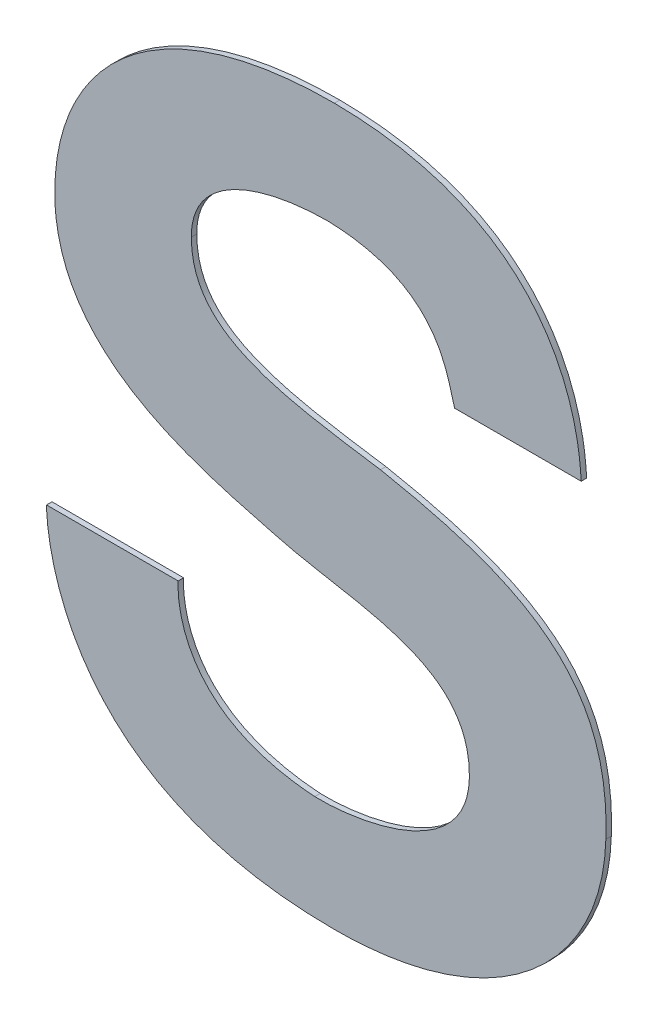
ISO-10303-21;
HEADER;
FILE_DESCRIPTION(('STEP AP214'),'2;1');
FILE_NAME('part.step','',(''),(''),'','','');
FILE_SCHEMA(('AUTOMOTIVE_DESIGN { 1 0 10303 214 1 1 1 1 }'));
ENDSEC;
DATA;
#1=APPLICATION_CONTEXT('core data for automotive mechanical design processes');
#2=APPLICATION_PROTOCOL_DEFINITION('international standard','automotive_design',2000,#1);
#3=PRODUCT_CONTEXT('',#1,'mechanical');
#4=PRODUCT('Part','Part','',(#3));
#5=PRODUCT_RELATED_PRODUCT_CATEGORY('part','',(#4));
#6=PRODUCT_DEFINITION_FORMATION('','',#4);
#7=PRODUCT_DEFINITION_CONTEXT('part definition',#1,'design');
#8=PRODUCT_DEFINITION('design','',#6,#7);
#9=PRODUCT_DEFINITION_SHAPE('','',#8);
#10=(LENGTH_UNIT() NAMED_UNIT(*) SI_UNIT(.MILLI.,.METRE.));
#11=(NAMED_UNIT(*) PLANE_ANGLE_UNIT() SI_UNIT($,.RADIAN.));
#12=(NAMED_UNIT(*) SI_UNIT($,.STERADIAN.) SOLID_ANGLE_UNIT());
#13=UNCERTAINTY_MEASURE_WITH_UNIT(LENGTH_MEASURE(1.E-05),#10,'distance_accuracy_value','');
#14=(GEOMETRIC_REPRESENTATION_CONTEXT(3) GLOBAL_UNCERTAINTY_ASSIGNED_CONTEXT((#13)) GLOBAL_UNIT_ASSIGNED_CONTEXT((#10,
#11,#12)) REPRESENTATION_CONTEXT('',''));
#15=CARTESIAN_POINT('',(0.,0.,0.));
#16=DIRECTION('',(0.,0.,1.));
#17=DIRECTION('',(1.,0.,0.));
#18=AXIS2_PLACEMENT_3D('',#15,#16,#17);
#19=CARTESIAN_POINT('',(-0.0821500048121,-0.1584020248666,0.00086146168299));
#20=CARTESIAN_POINT('',(-0.0821500048121,-0.1584020248666,-0.00033853831701));
#21=CARTESIAN_POINT('',(-0.1462058680997,-0.1584020248666,0.00086146168299));
#22=CARTESIAN_POINT('',(-0.1462058680997,-0.1584020248666,-0.00033853831701));
#23=CARTESIAN_POINT('',(-0.1454833792289,-0.1091766906306,0.00086146168299));
#24=CARTESIAN_POINT('',(-0.1454833792289,-0.1091766906306,-0.00033853831701));
#25=CARTESIAN_POINT('',(-0.1454833792289,-0.1091766906306,0.00086146168299));
#26=CARTESIAN_POINT('',(-0.1454833792289,-0.1091766906306,-0.00033853831701));
#27=B_SPLINE_SURFACE_WITH_KNOTS('',3,1,((#19,#20),(#21,#22),(#23,#24),(#25,#26)),.UNSPECIFIED.,
.F.,.F.,.F.,(4,4),(2,2),(0.,1.),(-0.003,0.),.UNSPECIFIED.);
#28=DIRECTION('',(0.,0.,1.));
#29=VECTOR('',#28,1.);
#30=CARTESIAN_POINT('',(-0.0821500048121,-0.1584020248666,-0.00033853831701));
#31=LINE('',#30,#29);
#32=CARTESIAN_POINT('',(-0.0821500048121,-0.1584020248666,-0.00033853831701));
#33=VERTEX_POINT('',#32);
#34=CARTESIAN_POINT('',(-0.0821500048121,-0.1584020248666,0.00086146168299));
#35=VERTEX_POINT('',#34);
#36=EDGE_CURVE('E11',#33,#35,#31,.T.);
#37=CARTESIAN_POINT('',(-0.0821500048121,-0.1584020248666,0.00086146168299));
#38=CARTESIAN_POINT('',(-0.1462058680997,-0.1584020248666,0.00086146168299));
#39=CARTESIAN_POINT('',(-0.1454833792289,-0.1091766906306,0.00086146168299));
#40=CARTESIAN_POINT('',(-0.1454833792289,-0.1091766906306,0.00086146168299));
#41=B_SPLINE_CURVE_WITH_KNOTS('',3,(#37,#38,#39,#40),.UNSPECIFIED.,.F.,.F.,(4,4),(0.,1.),.UNSPECIFIED.);
#42=CARTESIAN_POINT('',(-0.1454833792289,-0.1091766906306,0.00086146168299));
#43=VERTEX_POINT('',#42);
#44=EDGE_CURVE('E27',#35,#43,#41,.T.);
#45=DIRECTION('',(0.,0.,1.));
#46=VECTOR('',#45,1.);
#47=CARTESIAN_POINT('',(-0.1454833792289,-0.1091766906306,-0.00033853831701));
#48=LINE('',#47,#46);
#49=CARTESIAN_POINT('',(-0.1454833792289,-0.1091766906306,-0.00033853831701));
#50=VERTEX_POINT('',#49);
#51=EDGE_CURVE('E463',#50,#43,#48,.T.);
#52=CARTESIAN_POINT('',(-0.1454833792289,-0.1091766906306,-0.00033853831701));
#53=CARTESIAN_POINT('',(-0.145483351360445,-0.109360729450372,-0.00033853831701));
#54=CARTESIAN_POINT('',(-0.145480728177267,-0.109544730071209,-0.00033853831701));
#55=CARTESIAN_POINT('',(-0.145462138121236,-0.110249845682401,-0.00033853831701));
#56=CARTESIAN_POINT('',(-0.145430524637829,-0.110770558094025,-0.00033853831701));
#57=CARTESIAN_POINT('',(-0.145360024220722,-0.111662322107343,-0.00033853831701));
#58=CARTESIAN_POINT('',(-0.145325764635645,-0.112033809976754,-0.00033853831701));
#59=CARTESIAN_POINT('',(-0.145240348487986,-0.112843129793033,-0.00033853831701));
#60=CARTESIAN_POINT('',(-0.14518725363105,-0.113280764303225,-0.00033853831701));
#61=CARTESIAN_POINT('',(-0.145060474992482,-0.114216404701859,-0.00033853831701));
#62=CARTESIAN_POINT('',(-0.144984937970869,-0.11471415634059,-0.00033853831701));
#63=CARTESIAN_POINT('',(-0.144809135816948,-0.115764088824384,-0.00033853831701));
#64=CARTESIAN_POINT('',(-0.144707027823567,-0.116315961659016,-0.00033853831701));
#65=CARTESIAN_POINT('',(-0.144474088991036,-0.117468187532665,-0.00033853831701));
#66=CARTESIAN_POINT('',(-0.144341452637062,-0.118068175365677,-0.00033853831701));
#67=CARTESIAN_POINT('',(-0.144043407054792,-0.119310688072708,-0.00033853831701));
#68=CARTESIAN_POINT('',(-0.143876227624674,-0.119952788672094,-0.00033853831701));
#69=CARTESIAN_POINT('',(-0.143505057270025,-0.121273585538907,-0.00033853831701));
#70=CARTESIAN_POINT('',(-0.14329933464751,-0.121951795622221,-0.00033853831701));
#71=CARTESIAN_POINT('',(-0.142847031926248,-0.123338873970168,-0.00033853831701));
#72=CARTESIAN_POINT('',(-0.142598757415542,-0.124047190392925,-0.00033853831701));
#73=CARTESIAN_POINT('',(-0.142057307453913,-0.125488547024469,-0.00033853831701));
#74=CARTESIAN_POINT('',(-0.141762471013467,-0.126220964035894,-0.00033853831701));
#75=CARTESIAN_POINT('',(-0.141123853645802,-0.127704598024266,-0.00033853831701));
#76=CARTESIAN_POINT('',(-0.140778437193887,-0.128455112112871,-0.00033853831701));
#77=CARTESIAN_POINT('',(-0.14003463708288,-0.129969007354224,-0.00033853831701));
#78=CARTESIAN_POINT('',(-0.139634632075519,-0.130731592269143,-0.00033853831701));
#79=CARTESIAN_POINT('',(-0.138777592112296,-0.132263780850091,-0.00033853831701));
#80=CARTESIAN_POINT('',(-0.138318932025775,-0.133032479113961,-0.00033853831701));
#81=CARTESIAN_POINT('',(-0.13759203627867,-0.134175595511269,-0.00033853831701));
#82=CARTESIAN_POINT('',(-0.137339554233384,-0.134560117022666,-0.00033853831701));
#83=CARTESIAN_POINT('',(-0.136818645611881,-0.135328565029521,-0.00033853831701));
#84=CARTESIAN_POINT('',(-0.136550011497395,-0.135712351189906,-0.00033853831701));
#85=CARTESIAN_POINT('',(-0.135996308934881,-0.136478571556279,-0.00033853831701));
#86=CARTESIAN_POINT('',(-0.135711030256507,-0.136860853782863,-0.00033853831701));
#87=CARTESIAN_POINT('',(-0.135123539140316,-0.137623331299324,-0.00033853831701));
#88=CARTESIAN_POINT('',(-0.13482111300701,-0.138003361987664,-0.00033853831701));
#89=CARTESIAN_POINT('',(-0.134198830953341,-0.138760597088623,-0.00033853831701));
#90=CARTESIAN_POINT('',(-0.133878757410692,-0.139137622678421,-0.00033853831701));
#91=CARTESIAN_POINT('',(-0.133220684239551,-0.139888111291869,-0.00033853831701));
#92=CARTESIAN_POINT('',(-0.132882462635123,-0.140261379691531,-0.00033853831701));
#93=CARTESIAN_POINT('',(-0.132187597655354,-0.141003618785186,-0.00033853831701));
#94=CARTESIAN_POINT('',(-0.131830727676034,-0.141372377344987,-0.00033853831701));
#95=CARTESIAN_POINT('',(-0.131098070464384,-0.142104863404026,-0.00033853831701));
#96=CARTESIAN_POINT('',(-0.130722051886367,-0.142468359499429,-0.00033853831701));
#97=CARTESIAN_POINT('',(-0.129950602103594,-0.14318958895681,-0.00033853831701));
#98=CARTESIAN_POINT('',(-0.129554934893634,-0.143547069861152,-0.00033853831701));
#99=CARTESIAN_POINT('',(-0.12874369236338,-0.144255538996744,-0.00033853831701));
#100=CARTESIAN_POINT('',(-0.128327876678003,-0.144606251956923,-0.00033853831701));
#101=CARTESIAN_POINT('',(-0.127475841389328,-0.145300456949292,-0.00033853831701));
#102=CARTESIAN_POINT('',(-0.127039377594883,-0.145643649211447,-0.00033853831701));
#103=CARTESIAN_POINT('',(-0.126145549720498,-0.146322086153199,-0.00033853831701));
#104=CARTESIAN_POINT('',(-0.125687938398501,-0.1466570050062,-0.00033853831701));
#105=CARTESIAN_POINT('',(-0.124751318302122,-0.147318169933931,-0.00033853831701));
#106=CARTESIAN_POINT('',(-0.124272060248511,-0.147644062749599,-0.00033853831701));
#107=CARTESIAN_POINT('',(-0.123291648487834,-0.148286451672975,-0.00033853831701));
#108=CARTESIAN_POINT('',(-0.122790244703207,-0.148602565946205,-0.00033853831701));
#109=CARTESIAN_POINT('',(-0.121765042026264,-0.149224674878783,-0.00033853831701));
#110=CARTESIAN_POINT('',(-0.121240993698047,-0.149530258263965,-0.00033853831701));
#111=CARTESIAN_POINT('',(-0.120170001033674,-0.150130583253259,-0.00033853831701));
#112=CARTESIAN_POINT('',(-0.119622809510955,-0.150424883595435,-0.00033853831701));
#113=CARTESIAN_POINT('',(-0.118505027953494,-0.151001920751199,-0.00033853831701));
#114=CARTESIAN_POINT('',(-0.117934194715587,-0.151284186110281,-0.00033853831701));
#115=CARTESIAN_POINT('',(-0.116768625505557,-0.151836431629572,-0.00033853831701));
#116=CARTESIAN_POINT('',(-0.116173652127234,-0.152105910296291,-0.00033853831701));
#117=CARTESIAN_POINT('',(-0.114959296625723,-0.152631860484959,-0.00033853831701));
#118=CARTESIAN_POINT('',(-0.114339684736389,-0.15288780098885,-0.00033853831701));
#119=CARTESIAN_POINT('',(-0.113075544407278,-0.153385952276422,-0.00033853831701));
#120=CARTESIAN_POINT('',(-0.112430795664237,-0.153627603382524,-0.00033853831701));
#121=CARTESIAN_POINT('',(-0.111115872015641,-0.15409645233933,-0.00033853831701));
#122=CARTESIAN_POINT('',(-0.110445488022964,-0.154323063047108,-0.00033853831701));
#123=CARTESIAN_POINT('',(-0.109078782703052,-0.154761106367988,-0.00033853831701));
#124=CARTESIAN_POINT('',(-0.108382265151254,-0.154971925863251,-0.00033853831701));
#125=CARTESIAN_POINT('',(-0.106962779445422,-0.15537766045669,-0.00033853831701));
#126=CARTESIAN_POINT('',(-0.106239629408581,-0.155571938213452,-0.00033853831701));
#127=CARTESIAN_POINT('',(-0.104766366074435,-0.155943860857329,-0.00033853831701));
#128=CARTESIAN_POINT('',(-0.104016086612577,-0.156120846129281,-0.00033853831701));
#129=CARTESIAN_POINT('',(-0.102488042616814,-0.156457454795045,-0.00033853831701));
#130=CARTESIAN_POINT('',(-0.101710128517664,-0.156616398468307,-0.00033853831701));
#131=CARTESIAN_POINT('',(-0.100126323265778,-0.156916187122145,-0.00033853831701));
#132=CARTESIAN_POINT('',(-0.0993203009937292,-0.157056334343973,-0.00033853831701));
#133=CARTESIAN_POINT('',(-0.0968211268216679,-0.157454644271955,-0.00033853831701));
#134=CARTESIAN_POINT('',(-0.0951217199620538,-0.157674271272407,-0.00033853831701));
#135=CARTESIAN_POINT('',(-0.0916052825057377,-0.15803518483328,-0.00033853831701));
#136=CARTESIAN_POINT('',(-0.0897876698005681,-0.158170573990198,-0.00033853831701));
#137=CARTESIAN_POINT('',(-0.0860300315506175,-0.158356866385799,-0.00033853831701));
#138=CARTESIAN_POINT('',(-0.0840896980026502,-0.158401733545231,-0.00033853831701));
#139=CARTESIAN_POINT('',(-0.0821500048121,-0.1584020248666,-0.00033853831701));
#140=B_SPLINE_CURVE_WITH_KNOTS('',3,(#52,#53,#54,#55,#56,#57,#58,#59,#60,#61,#62,#63,#64,#65,
#66,#67,#68,#69,#70,#71,#72,#73,#74,#75,#76,#77,#78,#79,#80,#81,#82,#83,#84,#85,#86,#87,#88,#89,
#90,#91,#92,#93,#94,#95,#96,#97,#98,#99,#100,#101,#102,#103,#104,#105,#106,#107,#108,#109,#110,
#111,#112,#113,#114,#115,#116,#117,#118,#119,#120,#121,#122,#123,#124,#125,#126,#127,#128,#129,
#130,#131,#132,#133,#134,#135,#136,#137,#138,#139),.UNSPECIFIED.,.F.,.F.,(4,2,2,2,2,2,2,2,2,2,2,
2,2,2,2,2,2,2,2,2,2,2,2,2,2,2,2,2,2,2,2,2,2,2,2,2,2,2,2,2,2,2,2,4),(0.,0.000552033736339421,
0.0021161277826951,0.00323528358810032,0.00455758643524084,0.00606770847137976,
0.007751106557831,0.00959413352469571,0.0115841641997338,0.0137097369710427,0.0159607110129454,
0.0183284383232039,0.0208059483089453,0.0233881407727131,0.0260719808167896,0.0274518297871743,
0.0288569933080097,0.0302877535862148,0.0317445529973422,0.0332279973407134,0.0347388582454034,
0.0362780746246879,0.0378467530905508,0.0394461672588647,0.0410777558994993,0.0427431199131199,
0.0444440181466448,0.0461823620907901,0.0479602095341432,0.0497797572770549,0.0516433330336569,
0.0535533866700948,0.0555124809405955,0.0575232818897102,0.0595885490889293,0.0617111258693031,
0.0638939296995494,0.0661399428425376,0.0684522034033167,0.0708337968603425,0.0732878481495478,
0.0784254785191314,0.0838911459170419,0.0897106075121539),.UNSPECIFIED.);
#141=EDGE_CURVE('E374',#33,#50,#140,.F.);
#142=ORIENTED_EDGE('',*,*,#36,.T.);
#143=ORIENTED_EDGE('',*,*,#44,.T.);
#144=ORIENTED_EDGE('',*,*,#51,.F.);
#145=ORIENTED_EDGE('',*,*,#141,.F.);
#146=EDGE_LOOP('',(#142,#143,#144,#145));
#147=FACE_BOUND('',#146,.T.);
#148=ADVANCED_FACE('F17',(#147),#27,.T.);
#149=CARTESIAN_POINT('',(-0.1310047022575,-0.1091766906306,0.00086146168299));
#150=DIRECTION('',(0.,1.,0.));
#151=DIRECTION('',(0.,0.,1.));
#152=AXIS2_PLACEMENT_3D('',#149,#150,#151);
#153=PLANE('',#152);
#154=ORIENTED_EDGE('',*,*,#51,.T.);
#155=DIRECTION('',(1.,0.,0.));
#156=VECTOR('',#155,1.);
#157=CARTESIAN_POINT('',(-0.1454833792289,-0.1091766906306,0.00086146168299));
#158=LINE('',#157,#156);
#159=CARTESIAN_POINT('',(-0.1165260252861,-0.1091766906306,0.00086146168299));
#160=VERTEX_POINT('',#159);
#161=EDGE_CURVE('E370',#43,#160,#158,.T.);
#162=ORIENTED_EDGE('',*,*,#161,.T.);
#163=DIRECTION('',(0.,0.,1.));
#164=VECTOR('',#163,1.);
#165=CARTESIAN_POINT('',(-0.1165260252861,-0.1091766906306,-0.00033853831701));
#166=LINE('',#165,#164);
#167=CARTESIAN_POINT('',(-0.1165260252861,-0.1091766906306,-0.00033853831701));
#168=VERTEX_POINT('',#167);
#169=EDGE_CURVE('E366',#168,#160,#166,.T.);
#170=ORIENTED_EDGE('',*,*,#169,.F.);
#171=DIRECTION('',(1.,0.,0.));
#172=VECTOR('',#171,1.);
#173=CARTESIAN_POINT('',(-0.1454833792289,-0.1091766906306,-0.00033853831701));
#174=LINE('',#173,#172);
#175=EDGE_CURVE('E363',#50,#168,#174,.T.);
#176=ORIENTED_EDGE('',*,*,#175,.F.);
#177=EDGE_LOOP('',(#154,#162,#170,#176));
#178=FACE_BOUND('',#177,.T.);
#179=ADVANCED_FACE('F334',(#178),#153,.T.);
#180=CARTESIAN_POINT('',(-0.1165260252861,-0.1091766906306,0.00086146168299));
#181=CARTESIAN_POINT('',(-0.1165260252861,-0.1091766906306,-0.00033853831701));
#182=CARTESIAN_POINT('',(-0.1165260252861,-0.1091766906306,0.00086146168299));
#183=CARTESIAN_POINT('',(-0.1165260252861,-0.1091766906306,-0.00033853831701));
#184=CARTESIAN_POINT('',(-0.1187079416761,-0.1330643401666,0.00086146168299));
#185=CARTESIAN_POINT('',(-0.1187079416761,-0.1330643401666,-0.00033853831701));
#186=CARTESIAN_POINT('',(-0.0864704882597,-0.1352346967346,0.00086146168299));
#187=CARTESIAN_POINT('',(-0.0864704882597,-0.1352346967346,-0.00033853831701));
#188=B_SPLINE_SURFACE_WITH_KNOTS('',3,1,((#180,#181),(#182,#183),(#184,#185),(#186,#187)),
.UNSPECIFIED.,.F.,.F.,.F.,(4,4),(2,2),(0.,1.),(-0.003,0.),.UNSPECIFIED.);
#189=CARTESIAN_POINT('',(-0.1165260252861,-0.1091766906306,0.00086146168299));
#190=CARTESIAN_POINT('',(-0.1165260252861,-0.1091766906306,0.00086146168299));
#191=CARTESIAN_POINT('',(-0.1187079416761,-0.1330643401666,0.00086146168299));
#192=CARTESIAN_POINT('',(-0.0864704882597,-0.1352346967346,0.00086146168299));
#193=B_SPLINE_CURVE_WITH_KNOTS('',3,(#189,#190,#191,#192),.UNSPECIFIED.,.F.,.F.,(4,4),(0.,1.),.UNSPECIFIED.);
#194=CARTESIAN_POINT('',(-0.0864704882597,-0.1352346967346,0.00086146168299));
#195=VERTEX_POINT('',#194);
#196=EDGE_CURVE('E359',#160,#195,#193,.T.);
#197=DIRECTION('',(0.,0.,1.));
#198=VECTOR('',#197,1.);
#199=CARTESIAN_POINT('',(-0.0864704882597,-0.1352346967346,-0.00033853831701));
#200=LINE('',#199,#198);
#201=CARTESIAN_POINT('',(-0.0864704882597,-0.1352346967346,-0.00033853831701));
#202=VERTEX_POINT('',#201);
#203=EDGE_CURVE('E417',#202,#195,#200,.T.);
#204=CARTESIAN_POINT('',(-0.0864704882597,-0.1352346967346,-0.00033853831701));
#205=CARTESIAN_POINT('',(-0.087446468235695,-0.135168838608462,-0.00033853831701));
#206=CARTESIAN_POINT('',(-0.0884213422703465,-0.135081317455042,-0.00033853831701));
#207=CARTESIAN_POINT('',(-0.0903056365183247,-0.134863497188581,-0.00033853831701));
#208=CARTESIAN_POINT('',(-0.091215402606295,-0.13473615237631,-0.00033853831701));
#209=CARTESIAN_POINT('',(-0.0929717743653633,-0.134441681998604,-0.00033853831701));
#210=CARTESIAN_POINT('',(-0.0938188576695121,-0.134277445201759,-0.00033853831701));
#211=CARTESIAN_POINT('',(-0.0954519721029721,-0.133911983030957,-0.00033853831701));
#212=CARTESIAN_POINT('',(-0.096238621746766,-0.133713561388672,-0.00033853831701));
#213=CARTESIAN_POINT('',(-0.0973911126990717,-0.133385601492836,-0.00033853831701));
#214=CARTESIAN_POINT('',(-0.0977621700852248,-0.133274206124908,-0.00033853831701));
#215=CARTESIAN_POINT('',(-0.0984898973255775,-0.13304360573314,-0.00033853831701));
#216=CARTESIAN_POINT('',(-0.0988466697834757,-0.132924725945563,-0.00033853831701));
#217=CARTESIAN_POINT('',(-0.099546087220889,-0.132679519343725,-0.00033853831701));
#218=CARTESIAN_POINT('',(-0.0998888424344104,-0.132553507192814,-0.00033853831701));
#219=CARTESIAN_POINT('',(-0.100560500343674,-0.132294393831359,-0.00033853831701));
#220=CARTESIAN_POINT('',(-0.100889519871551,-0.13216159590757,-0.00033853831701));
#221=CARTESIAN_POINT('',(-0.10153397836662,-0.131889271389021,-0.00033853831701));
#222=CARTESIAN_POINT('',(-0.101849540156855,-0.131750035784443,-0.00033853831701));
#223=CARTESIAN_POINT('',(-0.1024673568312,-0.131465196782689,-0.00033853831701));
#224=CARTESIAN_POINT('',(-0.102769739718152,-0.13131987131946,-0.00033853831701));
#225=CARTESIAN_POINT('',(-0.103361472828765,-0.131023214318705,-0.00033853831701));
#226=CARTESIAN_POINT('',(-0.103650955397409,-0.130872147015318,-0.00033853831701));
#227=CARTESIAN_POINT('',(-0.104217163062552,-0.130564368631846,-0.00033853831701));
#228=CARTESIAN_POINT('',(-0.104494023960365,-0.130407907591844,-0.00033853831701));
#229=CARTESIAN_POINT('',(-0.105035264381286,-0.130089704486549,-0.00033853831701));
#230=CARTESIAN_POINT('',(-0.10529978226005,-0.129928197931331,-0.00033853831701));
#231=CARTESIAN_POINT('',(-0.105816613679504,-0.129600266824396,-0.00033853831701));
#232=CARTESIAN_POINT('',(-0.106069067232889,-0.129434063084238,-0.00033853831701));
#233=CARTESIAN_POINT('',(-0.106562047960525,-0.12909710074059,-0.00033853831701));
#234=CARTESIAN_POINT('',(-0.106802715936579,-0.128926548251368,-0.00033853831701));
#235=CARTESIAN_POINT('',(-0.107272404355556,-0.128581251470931,-0.00033853831701));
#236=CARTESIAN_POINT('',(-0.107501565574013,-0.128406698764385,-0.00033853831701));
#237=CARTESIAN_POINT('',(-0.107948520150186,-0.128053764368798,-0.00033853831701));
#238=CARTESIAN_POINT('',(-0.108166453515777,-0.127875560059806,-0.00033853831701));
#239=CARTESIAN_POINT('',(-0.108591232803322,-0.127515684878403,-0.00033853831701));
#240=CARTESIAN_POINT('',(-0.108798217316345,-0.127334177649143,-0.00033853831701));
#241=CARTESIAN_POINT('',(-0.109201379961013,-0.126968058504043,-0.00033853831701));
#242=CARTESIAN_POINT('',(-0.109397694724163,-0.126783597085833,-0.00033853831701));
#243=CARTESIAN_POINT('',(-0.109779799463376,-0.126411930777575,-0.00033853831701));
#244=CARTESIAN_POINT('',(-0.109965723684349,-0.126224863932094,-0.00033853831701));
#245=CARTESIAN_POINT('',(-0.110327329345116,-0.125848347224268,-0.00033853831701));
#246=CARTESIAN_POINT('',(-0.110503142336102,-0.12565902372232,-0.00033853831701));
#247=CARTESIAN_POINT('',(-0.110844807827693,-0.125278353333607,-0.00033853831701));
#248=CARTESIAN_POINT('',(-0.111010788997712,-0.125087121942736,-0.00033853831701));
#249=CARTESIAN_POINT('',(-0.11133307331112,-0.124702994518794,-0.00033853831701));
#250=CARTESIAN_POINT('',(-0.111489502167259,-0.124510203963222,-0.00033853831701));
#251=CARTESIAN_POINT('',(-0.111792964339563,-0.12412331613041,-0.00033853831701));
#252=CARTESIAN_POINT('',(-0.111940120441282,-0.123929315159521,-0.00033853831701));
#253=CARTESIAN_POINT('',(-0.112225319638871,-0.123540363292615,-0.00033853831701));
#254=CARTESIAN_POINT('',(-0.112363482710916,-0.123345500367159,-0.00033853831701));
#255=CARTESIAN_POINT('',(-0.112630977876017,-0.122955181405417,-0.00033853831701));
#256=CARTESIAN_POINT('',(-0.112760427338207,-0.122759805783256,-0.00033853831701));
#257=CARTESIAN_POINT('',(-0.113010778415879,-0.122368814256406,-0.00033853831701));
#258=CARTESIAN_POINT('',(-0.113131795023678,-0.122173272016275,-0.00033853831701));
#259=CARTESIAN_POINT('',(-0.113365558455791,-0.121782310828414,-0.00033853831701));
#260=CARTESIAN_POINT('',(-0.113478418283831,-0.12158695926878,-0.00033853831701));
#261=CARTESIAN_POINT('',(-0.113801877776717,-0.121007231306466,-0.00033853831701));
#262=CARTESIAN_POINT('',(-0.114004323176077,-0.120618262123253,-0.00033853831701));
#263=CARTESIAN_POINT('',(-0.114379042170833,-0.11984486095923,-0.00033853831701));
#264=CARTESIAN_POINT('',(-0.114552187934106,-0.119460849768544,-0.00033853831701));
#265=CARTESIAN_POINT('',(-0.114870585945235,-0.118700181616692,-0.00033853831701));
#266=CARTESIAN_POINT('',(-0.115016700010931,-0.118323885260235,-0.00033853831701));
#267=CARTESIAN_POINT('',(-0.115283275548127,-0.117581491717574,-0.00033853831701));
#268=CARTESIAN_POINT('',(-0.115404598541388,-0.117215703354855,-0.00033853831701));
#269=CARTESIAN_POINT('',(-0.115623830403602,-0.11649715131465,-0.00033853831701));
#270=CARTESIAN_POINT('',(-0.115722607257947,-0.116144652100311,-0.00033853831701));
#271=CARTESIAN_POINT('',(-0.115898976326669,-0.11545550039635,-0.00033853831701));
#272=CARTESIAN_POINT('',(-0.115977447973857,-0.115119072645708,-0.00033853831701));
#273=CARTESIAN_POINT('',(-0.116115432506276,-0.114464881190458,-0.00033853831701));
#274=CARTESIAN_POINT('',(-0.116175839066477,-0.114147305762056,-0.00033853831701));
#275=CARTESIAN_POINT('',(-0.116279913593749,-0.113533634309713,-0.00033853831701));
#276=CARTESIAN_POINT('',(-0.116324490788786,-0.113237692314168,-0.00033853831701));
#277=CARTESIAN_POINT('',(-0.116399135006908,-0.112670100070181,-0.00033853831701));
#278=CARTESIAN_POINT('',(-0.116430125760896,-0.112398571409239,-0.00033853831701));
#279=CARTESIAN_POINT('',(-0.116479795326467,-0.111882621335133,-0.00033853831701));
#280=CARTESIAN_POINT('',(-0.116499413810285,-0.111638290095423,-0.00033853831701));
#281=CARTESIAN_POINT('',(-0.116528635908864,-0.111179535513261,-0.00033853831701));
#282=CARTESIAN_POINT('',(-0.116539181951146,-0.110965173830978,-0.00033853831701));
#283=CARTESIAN_POINT('',(-0.116552257645996,-0.11056920082987,-0.00033853831701));
#284=CARTESIAN_POINT('',(-0.116555770059818,-0.110387618257716,-0.00033853831701));
#285=CARTESIAN_POINT('',(-0.11655829343076,-0.109952144964724,-0.00033853831701));
#286=CARTESIAN_POINT('',(-0.116554959968103,-0.10969820399702,-0.00033853831701));
#287=CARTESIAN_POINT('',(-0.116538271447584,-0.109355305092137,-0.00033853831701));
#288=CARTESIAN_POINT('',(-0.116532800432236,-0.109265958238882,-0.00033853831701));
#289=CARTESIAN_POINT('',(-0.1165260252861,-0.1091766906306,-0.00033853831701));
#290=B_SPLINE_CURVE_WITH_KNOTS('',3,(#204,#205,#206,#207,#208,#209,#210,#211,#212,#213,#214,
#215,#216,#217,#218,#219,#220,#221,#222,#223,#224,#225,#226,#227,#228,#229,#230,#231,#232,#233,
#234,#235,#236,#237,#238,#239,#240,#241,#242,#243,#244,#245,#246,#247,#248,#249,#250,#251,#252,
#253,#254,#255,#256,#257,#258,#259,#260,#261,#262,#263,#264,#265,#266,#267,#268,#269,#270,#271,
#272,#273,#274,#275,#276,#277,#278,#279,#280,#281,#282,#283,#284,#285,#286,#287,#288,#289),
.UNSPECIFIED.,.F.,.F.,(4,2,2,2,2,2,2,2,2,2,2,2,2,2,2,2,2,2,2,2,2,2,2,2,2,2,2,2,2,2,2,2,2,2,2,2,
2,2,2,2,2,2,4),(0.,0.00293487559765998,0.00568967141370913,0.00827700800156116,
0.0107094164339985,0.0118715222021461,0.0129995149515018,0.0140948965249388,0.015159144578036,
0.0161937084639682,0.0172000048928512,0.0181794134101965,0.0191332717492506,0.0200628711212416,
0.0209694515152742,0.0218541970852162,0.0227182317038579,0.0235626147645196,0.0243883373069349,
0.0251963185376806,0.0259874028059222,0.0267623570832827,0.0275218689828903,0.0282665453378889,
0.0289969113447296,0.0297134102621888,0.0304164036439701,0.0311061720714872,0.0317829163443615,
0.033097609597726,0.0343607191489345,0.0355711814666176,0.0367268781980959,0.0378247299626257,
0.0388607912623984,0.0398303427529448,0.0407279783197698,0.0415476854293825,0.0422829180185085,
0.0429266617611114,0.0434714919399258,0.0442329001371919,0.0445014301082946),.UNSPECIFIED.);
#291=EDGE_CURVE('E315',#168,#202,#290,.F.);
#292=ORIENTED_EDGE('',*,*,#169,.T.);
#293=ORIENTED_EDGE('',*,*,#196,.T.);
#294=ORIENTED_EDGE('',*,*,#203,.F.);
#295=ORIENTED_EDGE('',*,*,#291,.F.);
#296=EDGE_LOOP('',(#292,#293,#294,#295));
#297=FACE_BOUND('',#296,.T.);
#298=ADVANCED_FACE('F322',(#297),#188,.T.);
#299=CARTESIAN_POINT('',(-0.0864704882597,-0.1352346967346,0.00086146168299));
#300=CARTESIAN_POINT('',(-0.0864704882597,-0.1352346967346,-0.00057853831701));
#301=CARTESIAN_POINT('',(-0.0785086609032999,-0.1355988311254,0.00086146168299));
#302=CARTESIAN_POINT('',(-0.0785086609032999,-0.1355988311254,-0.00057853831701));
#303=CARTESIAN_POINT('',(-0.0524557122209,-0.1323476312066,0.00086146168299));
#304=CARTESIAN_POINT('',(-0.0524557122209,-0.1323476312066,-0.00057853831701));
#305=CARTESIAN_POINT('',(-0.0524557122209,-0.1142456725482,0.00086146168299));
#306=CARTESIAN_POINT('',(-0.0524557122209,-0.1142456725482,-0.00057853831701));
#307=B_SPLINE_SURFACE_WITH_KNOTS('',3,1,((#299,#300),(#301,#302),(#303,#304),(#305,#306)),
.UNSPECIFIED.,.F.,.F.,.F.,(4,4),(2,2),(0.,1.),(0.,0.00036),.UNSPECIFIED.);
#308=CARTESIAN_POINT('',(-0.0864704882597,-0.1352346967346,0.00086146168299));
#309=CARTESIAN_POINT('',(-0.0785086609032999,-0.1355988311254,0.00086146168299));
#310=CARTESIAN_POINT('',(-0.0524557122209,-0.1323476312066,0.00086146168299));
#311=CARTESIAN_POINT('',(-0.0524557122209,-0.1142456725482,0.00086146168299));
#312=B_SPLINE_CURVE_WITH_KNOTS('',3,(#308,#309,#310,#311),.UNSPECIFIED.,.F.,.F.,(4,4),(0.,1.),.UNSPECIFIED.);
#313=CARTESIAN_POINT('',(-0.0524557122209,-0.1142456725482,0.00086146168299));
#314=VERTEX_POINT('',#313);
#315=EDGE_CURVE('E306',#195,#314,#312,.T.);
#316=DIRECTION('',(0.,0.,1.));
#317=VECTOR('',#316,1.);
#318=CARTESIAN_POINT('',(-0.0524557122209,-0.1142456725482,-0.00033853831701));
#319=LINE('',#318,#317);
#320=CARTESIAN_POINT('',(-0.0524557122209,-0.1142456725482,-0.00033853831701));
#321=VERTEX_POINT('',#320);
#322=EDGE_CURVE('E303',#321,#314,#319,.T.);
#323=CARTESIAN_POINT('',(-0.0864704882597,-0.1352346967346,-0.00033853831701));
#324=CARTESIAN_POINT('',(-0.0785086609032999,-0.1355988311254,-0.00033853831701));
#325=CARTESIAN_POINT('',(-0.0524557122209,-0.1323476312066,-0.00033853831701));
#326=CARTESIAN_POINT('',(-0.0524557122209,-0.1142456725482,-0.00033853831701));
#327=B_SPLINE_CURVE_WITH_KNOTS('',3,(#323,#324,#325,#326),.UNSPECIFIED.,.F.,.F.,(4,4),(0.,1.),.UNSPECIFIED.);
#328=EDGE_CURVE('E290',#202,#321,#327,.T.);
#329=ORIENTED_EDGE('',*,*,#203,.T.);
#330=ORIENTED_EDGE('',*,*,#315,.T.);
#331=ORIENTED_EDGE('',*,*,#322,.F.);
#332=ORIENTED_EDGE('',*,*,#328,.F.);
#333=EDGE_LOOP('',(#329,#330,#331,#332));
#334=FACE_BOUND('',#333,.T.);
#335=ADVANCED_FACE('F333',(#334),#307,.T.);
#336=CARTESIAN_POINT('',(-0.0524557122209,-0.1142456725482,0.00086146168299));
#337=CARTESIAN_POINT('',(-0.0524557122209,-0.1142456725482,-0.00057853831701));
#338=CARTESIAN_POINT('',(-0.0524557122209,-0.0932624282726,0.00086146168299));
#339=CARTESIAN_POINT('',(-0.0524557122209,-0.0932624282726,-0.00057853831701));
#340=CARTESIAN_POINT('',(-0.0788915800044999,-0.094329544335,0.00086146168299));
#341=CARTESIAN_POINT('',(-0.0788915800044999,-0.094329544335,-0.00057853831701));
#342=CARTESIAN_POINT('',(-0.0955232738108999,-0.0896413140522,0.00086146168299));
#343=CARTESIAN_POINT('',(-0.0955232738108999,-0.0896413140522,-0.00057853831701));
#344=B_SPLINE_SURFACE_WITH_KNOTS('',3,1,((#336,#337),(#338,#339),(#340,#341),(#342,#343)),
.UNSPECIFIED.,.F.,.F.,.F.,(4,4),(2,2),(0.,1.),(0.,0.00036),.UNSPECIFIED.);
#345=CARTESIAN_POINT('',(-0.0524557122209,-0.1142456725482,0.00086146168299));
#346=CARTESIAN_POINT('',(-0.0524557122209,-0.0932624282726,0.00086146168299));
#347=CARTESIAN_POINT('',(-0.0788915800044999,-0.094329544335,0.00086146168299));
#348=CARTESIAN_POINT('',(-0.0955232738108999,-0.0896413140522,0.00086146168299));
#349=B_SPLINE_CURVE_WITH_KNOTS('',3,(#345,#346,#347,#348),.UNSPECIFIED.,.F.,.F.,(4,4),(0.,1.),.UNSPECIFIED.);
#350=CARTESIAN_POINT('',(-0.0955232738108999,-0.0896413140522,0.00086146168299));
#351=VERTEX_POINT('',#350);
#352=EDGE_CURVE('E286',#314,#351,#349,.T.);
#353=DIRECTION('',(0.,0.,1.));
#354=VECTOR('',#353,1.);
#355=CARTESIAN_POINT('',(-0.0955232738108999,-0.0896413140522,-0.00033853831701));
#356=LINE('',#355,#354);
#357=CARTESIAN_POINT('',(-0.0955232738108999,-0.0896413140522,-0.00033853831701));
#358=VERTEX_POINT('',#357);
#359=EDGE_CURVE('E280',#358,#351,#356,.T.);
#360=CARTESIAN_POINT('',(-0.0524557122209,-0.1142456725482,-0.00033853831701));
#361=CARTESIAN_POINT('',(-0.0524557122209,-0.0932624282726,-0.00033853831701));
#362=CARTESIAN_POINT('',(-0.0788915800044999,-0.094329544335,-0.00033853831701));
#363=CARTESIAN_POINT('',(-0.0955232738108999,-0.0896413140522,-0.00033853831701));
#364=B_SPLINE_CURVE_WITH_KNOTS('',3,(#360,#361,#362,#363),.UNSPECIFIED.,.F.,.F.,(4,4),(0.,1.),.UNSPECIFIED.);
#365=EDGE_CURVE('E272',#321,#358,#364,.T.);
#366=ORIENTED_EDGE('',*,*,#322,.T.);
#367=ORIENTED_EDGE('',*,*,#352,.T.);
#368=ORIENTED_EDGE('',*,*,#359,.F.);
#369=ORIENTED_EDGE('',*,*,#365,.F.);
#370=EDGE_LOOP('',(#366,#367,#368,#369));
#371=FACE_BOUND('',#370,.T.);
#372=ADVANCED_FACE('F433',(#371),#344,.T.);
#373=CARTESIAN_POINT('',(-0.0955232738108999,-0.0896413140522,0.00086146168299));
#374=CARTESIAN_POINT('',(-0.0955232738108999,-0.0896413140522,-0.00057853831701));
#375=CARTESIAN_POINT('',(-0.1121910920609,-0.0852868736278,0.00086146168299));
#376=CARTESIAN_POINT('',(-0.1121910920609,-0.0852868736278,-0.00057853831701));
#377=CARTESIAN_POINT('',(-0.1436699321629,-0.0780475351422,0.00086146168299));
#378=CARTESIAN_POINT('',(-0.1436699321629,-0.0780475351422,-0.00057853831701));
#379=CARTESIAN_POINT('',(-0.1436699321629,-0.0487390516082,0.00086146168299));
#380=CARTESIAN_POINT('',(-0.1436699321629,-0.0487390516082,-0.00057853831701));
#381=B_SPLINE_SURFACE_WITH_KNOTS('',3,1,((#373,#374),(#375,#376),(#377,#378),(#379,#380)),
.UNSPECIFIED.,.F.,.F.,.F.,(4,4),(2,2),(0.,1.),(0.,0.00036),.UNSPECIFIED.);
#382=CARTESIAN_POINT('',(-0.0955232738108999,-0.0896413140522,0.00086146168299));
#383=CARTESIAN_POINT('',(-0.1121910920609,-0.0852868736278,0.00086146168299));
#384=CARTESIAN_POINT('',(-0.1436699321629,-0.0780475351422,0.00086146168299));
#385=CARTESIAN_POINT('',(-0.1436699321629,-0.0487390516082,0.00086146168299));
#386=B_SPLINE_CURVE_WITH_KNOTS('',3,(#382,#383,#384,#385),.UNSPECIFIED.,.F.,.F.,(4,4),(0.,1.),.UNSPECIFIED.);
#387=CARTESIAN_POINT('',(-0.1436699321629,-0.0487390516082,0.00086146168299));
#388=VERTEX_POINT('',#387);
#389=EDGE_CURVE('E268',#351,#388,#386,.T.);
#390=DIRECTION('',(0.,0.,1.));
#391=VECTOR('',#390,1.);
#392=CARTESIAN_POINT('',(-0.1436699321629,-0.0487390516082,-0.00033853831701));
#393=LINE('',#392,#391);
#394=CARTESIAN_POINT('',(-0.1436699321629,-0.0487390516082,-0.00033853831701));
#395=VERTEX_POINT('',#394);
#396=EDGE_CURVE('E262',#395,#388,#393,.T.);
#397=CARTESIAN_POINT('',(-0.0955232738108999,-0.0896413140522,-0.00033853831701));
#398=CARTESIAN_POINT('',(-0.1121910920609,-0.0852868736278,-0.00033853831701));
#399=CARTESIAN_POINT('',(-0.1436699321629,-0.0780475351422,-0.00033853831701));
#400=CARTESIAN_POINT('',(-0.1436699321629,-0.0487390516082,-0.00033853831701));
#401=B_SPLINE_CURVE_WITH_KNOTS('',3,(#397,#398,#399,#400),.UNSPECIFIED.,.F.,.F.,(4,4),(0.,1.),.UNSPECIFIED.);
#402=EDGE_CURVE('E254',#358,#395,#401,.T.);
#403=ORIENTED_EDGE('',*,*,#359,.T.);
#404=ORIENTED_EDGE('',*,*,#389,.T.);
#405=ORIENTED_EDGE('',*,*,#396,.F.);
#406=ORIENTED_EDGE('',*,*,#402,.F.);
#407=EDGE_LOOP('',(#403,#404,#405,#406));
#408=FACE_BOUND('',#407,.T.);
#409=ADVANCED_FACE('F437',(#408),#381,.T.);
#410=CARTESIAN_POINT('',(-0.1436699321629,-0.0487390516082,0.00086146168299));
#411=CARTESIAN_POINT('',(-0.1436699321629,-0.0487390516082,-0.00057853831701));
#412=CARTESIAN_POINT('',(-0.1436699321629,-0.023048069850372,0.00086146168299));
#413=CARTESIAN_POINT('',(-0.1436699321629,-0.023048069850372,-0.00057853831701));
#414=CARTESIAN_POINT('',(-0.1226816304653,-0.000964475024684012,0.00086146168299));
#415=CARTESIAN_POINT('',(-0.1226816304653,-0.000964475024684012,-0.00057853831701));
#416=CARTESIAN_POINT('',(-0.0821500048121,-0.000964475024684012,0.00086146168299));
#417=CARTESIAN_POINT('',(-0.0821500048121,-0.000964475024684012,-0.00057853831701));
#418=B_SPLINE_SURFACE_WITH_KNOTS('',3,1,((#410,#411),(#412,#413),(#414,#415),(#416,#417)),
.UNSPECIFIED.,.F.,.F.,.F.,(4,4),(2,2),(0.,1.),(0.,0.00036),.UNSPECIFIED.);
#419=CARTESIAN_POINT('',(-0.1436699321629,-0.0487390516082,0.00086146168299));
#420=CARTESIAN_POINT('',(-0.1436699321629,-0.023048069850372,0.00086146168299));
#421=CARTESIAN_POINT('',(-0.1226816304653,-0.000964475024684012,0.00086146168299));
#422=CARTESIAN_POINT('',(-0.0821500048121,-0.000964475024684012,0.00086146168299));
#423=B_SPLINE_CURVE_WITH_KNOTS('',3,(#419,#420,#421,#422),.UNSPECIFIED.,.F.,.F.,(4,4),(0.,1.),.UNSPECIFIED.);
#424=CARTESIAN_POINT('',(-0.0821500048121,-0.000964475024684012,0.00086146168299));
#425=VERTEX_POINT('',#424);
#426=EDGE_CURVE('E250',#388,#425,#423,.T.);
#427=DIRECTION('',(0.,0.,1.));
#428=VECTOR('',#427,1.);
#429=CARTESIAN_POINT('',(-0.0821500048121,-0.000964475024684012,-0.00033853831701));
#430=LINE('',#429,#428);
#431=CARTESIAN_POINT('',(-0.0821500048121,-0.000964475024684012,-0.00033853831701));
#432=VERTEX_POINT('',#431);
#433=EDGE_CURVE('E244',#432,#425,#430,.T.);
#434=CARTESIAN_POINT('',(-0.1436699321629,-0.0487390516082,-0.00033853831701));
#435=CARTESIAN_POINT('',(-0.1436699321629,-0.023048069850372,-0.00033853831701));
#436=CARTESIAN_POINT('',(-0.1226816304653,-0.000964475024684012,-0.00033853831701));
#437=CARTESIAN_POINT('',(-0.0821500048121,-0.000964475024684012,-0.00033853831701));
#438=B_SPLINE_CURVE_WITH_KNOTS('',3,(#434,#435,#436,#437),.UNSPECIFIED.,.F.,.F.,(4,4),(0.,1.),.UNSPECIFIED.);
#439=EDGE_CURVE('E236',#395,#432,#438,.T.);
#440=ORIENTED_EDGE('',*,*,#396,.T.);
#441=ORIENTED_EDGE('',*,*,#426,.T.);
#442=ORIENTED_EDGE('',*,*,#433,.F.);
#443=ORIENTED_EDGE('',*,*,#439,.F.);
#444=EDGE_LOOP('',(#440,#441,#442,#443));
#445=FACE_BOUND('',#444,.T.);
#446=ADVANCED_FACE('F441',(#445),#418,.T.);
#447=CARTESIAN_POINT('',(-0.0821500048121,-0.000964475024684012,0.00086146168299));
#448=CARTESIAN_POINT('',(-0.0821500048121,-0.000964475024684012,-0.00057853831701));
#449=CARTESIAN_POINT('',(-0.0278477412809,-0.00133149937106401,0.00086146168299));
#450=CARTESIAN_POINT('',(-0.0278477412809,-0.00133149937106401,-0.00057853831701));
#451=CARTESIAN_POINT('',(-0.0282162106048999,-0.0433174951214,0.00086146168299));
#452=CARTESIAN_POINT('',(-0.0282162106048999,-0.0433174951214,-0.00057853831701));
#453=CARTESIAN_POINT('',(-0.0278477412809,-0.0458519860802,0.00086146168299));
#454=CARTESIAN_POINT('',(-0.0278477412809,-0.0458519860802,-0.00057853831701));
#455=B_SPLINE_SURFACE_WITH_KNOTS('',3,1,((#447,#448),(#449,#450),(#451,#452),(#453,#454)),
.UNSPECIFIED.,.F.,.F.,.F.,(4,4),(2,2),(0.,1.),(0.,0.00036),.UNSPECIFIED.);
#456=CARTESIAN_POINT('',(-0.0821500048121,-0.000964475024684012,0.00086146168299));
#457=CARTESIAN_POINT('',(-0.0278477412809,-0.00133149937106401,0.00086146168299));
#458=CARTESIAN_POINT('',(-0.0282162106048999,-0.0433174951214,0.00086146168299));
#459=CARTESIAN_POINT('',(-0.0278477412809,-0.0458519860802,0.00086146168299));
#460=B_SPLINE_CURVE_WITH_KNOTS('',3,(#456,#457,#458,#459),.UNSPECIFIED.,.F.,.F.,(4,4),(0.,1.),.UNSPECIFIED.);
#461=CARTESIAN_POINT('',(-0.0278477412809,-0.0458519860802,0.00086146168299));
#462=VERTEX_POINT('',#461);
#463=EDGE_CURVE('E232',#425,#462,#460,.T.);
#464=DIRECTION('',(0.,0.,1.));
#465=VECTOR('',#464,1.);
#466=CARTESIAN_POINT('',(-0.0278477412809,-0.0458519860802,-0.00033853831701));
#467=LINE('',#466,#465);
#468=CARTESIAN_POINT('',(-0.0278477412809,-0.0458519860802,-0.00033853831701));
#469=VERTEX_POINT('',#468);
#470=EDGE_CURVE('E226',#469,#462,#467,.T.);
#471=CARTESIAN_POINT('',(-0.0821500048121,-0.000964475024684012,-0.00033853831701));
#472=CARTESIAN_POINT('',(-0.0278477412809,-0.00133149937106401,-0.00033853831701));
#473=CARTESIAN_POINT('',(-0.0282162106048999,-0.0433174951214,-0.00033853831701));
#474=CARTESIAN_POINT('',(-0.0278477412809,-0.0458519860802,-0.00033853831701));
#475=B_SPLINE_CURVE_WITH_KNOTS('',3,(#471,#472,#473,#474),.UNSPECIFIED.,.F.,.F.,(4,4),(0.,1.),.UNSPECIFIED.);
#476=EDGE_CURVE('E221',#432,#469,#475,.T.);
#477=ORIENTED_EDGE('',*,*,#433,.T.);
#478=ORIENTED_EDGE('',*,*,#463,.T.);
#479=ORIENTED_EDGE('',*,*,#470,.F.);
#480=ORIENTED_EDGE('',*,*,#476,.F.);
#481=EDGE_LOOP('',(#477,#478,#479,#480));
#482=FACE_BOUND('',#481,.T.);
#483=ADVANCED_FACE('F444',(#482),#455,.T.);
#484=CARTESIAN_POINT('',(-0.0417773267103001,-0.0458519860802,0.00086146168299));
#485=DIRECTION('',(0.,-1.,0.));
#486=DIRECTION('',(0.,0.,-1.));
#487=AXIS2_PLACEMENT_3D('',#484,#485,#486);
#488=PLANE('',#487);
#489=ORIENTED_EDGE('',*,*,#470,.T.);
#490=DIRECTION('',(-1.,0.,0.));
#491=VECTOR('',#490,1.);
#492=CARTESIAN_POINT('',(-0.0278477412809,-0.0458519860802,0.00086146168299));
#493=LINE('',#492,#491);
#494=CARTESIAN_POINT('',(-0.0557069121397,-0.0458519860802,0.00086146168299));
#495=VERTEX_POINT('',#494);
#496=EDGE_CURVE('E219',#462,#495,#493,.T.);
#497=ORIENTED_EDGE('',*,*,#496,.T.);
#498=DIRECTION('',(0.,0.,1.));
#499=VECTOR('',#498,1.);
#500=CARTESIAN_POINT('',(-0.0557069121397,-0.0458519860802,-0.00033853831701));
#501=LINE('',#500,#499);
#502=CARTESIAN_POINT('',(-0.0557069121397,-0.0458519860802,-0.00033853831701));
#503=VERTEX_POINT('',#502);
#504=EDGE_CURVE('E216',#503,#495,#501,.T.);
#505=ORIENTED_EDGE('',*,*,#504,.F.);
#506=DIRECTION('',(-1.,0.,0.));
#507=VECTOR('',#506,1.);
#508=CARTESIAN_POINT('',(-0.0278477412809,-0.0458519860802,-0.00033853831701));
#509=LINE('',#508,#507);
#510=EDGE_CURVE('E210',#469,#503,#509,.T.);
#511=ORIENTED_EDGE('',*,*,#510,.F.);
#512=EDGE_LOOP('',(#489,#497,#505,#511));
#513=FACE_BOUND('',#512,.T.);
#514=ADVANCED_FACE('F449',(#513),#488,.T.);
#515=CARTESIAN_POINT('',(-0.0557069121397,-0.0458519860802,0.00086146168299));
#516=CARTESIAN_POINT('',(-0.0557069121397,-0.0458519860802,-0.00057853831701));
#517=CARTESIAN_POINT('',(-0.0575420338716999,-0.0396826536122,0.00086146168299));
#518=CARTESIAN_POINT('',(-0.0575420338716999,-0.0396826536122,-0.00057853831701));
#519=CARTESIAN_POINT('',(-0.0593410311601,-0.024852124560828,0.00086146168299));
#520=CARTESIAN_POINT('',(-0.0593410311601,-0.024852124560828,-0.00057853831701));
#521=CARTESIAN_POINT('',(-0.0835805327765,-0.024134693112096,0.00086146168299));
#522=CARTESIAN_POINT('',(-0.0835805327765,-0.024134693112096,-0.00057853831701));
#523=B_SPLINE_SURFACE_WITH_KNOTS('',3,1,((#515,#516),(#517,#518),(#519,#520),(#521,#522)),
.UNSPECIFIED.,.F.,.F.,.F.,(4,4),(2,2),(0.,1.),(0.,0.00036),.UNSPECIFIED.);
#524=CARTESIAN_POINT('',(-0.0557069121397,-0.0458519860802,0.00086146168299));
#525=CARTESIAN_POINT('',(-0.0575420338716999,-0.0396826536122,0.00086146168299));
#526=CARTESIAN_POINT('',(-0.0593410311601,-0.024852124560828,0.00086146168299));
#527=CARTESIAN_POINT('',(-0.0835805327765,-0.024134693112096,0.00086146168299));
#528=B_SPLINE_CURVE_WITH_KNOTS('',3,(#524,#525,#526,#527),.UNSPECIFIED.,.F.,.F.,(4,4),(0.,1.),.UNSPECIFIED.);
#529=CARTESIAN_POINT('',(-0.0835805327765,-0.024134693112096,0.00086146168299));
#530=VERTEX_POINT('',#529);
#531=EDGE_CURVE('E206',#495,#530,#528,.T.);
#532=DIRECTION('',(0.,0.,1.));
#533=VECTOR('',#532,1.);
#534=CARTESIAN_POINT('',(-0.0835805327765,-0.024134693112096,-0.00033853831701));
#535=LINE('',#534,#533);
#536=CARTESIAN_POINT('',(-0.0835805327765,-0.024134693112096,-0.00033853831701));
#537=VERTEX_POINT('',#536);
#538=EDGE_CURVE('E200',#537,#530,#535,.T.);
#539=CARTESIAN_POINT('',(-0.0557069121397,-0.0458519860802,-0.00033853831701));
#540=CARTESIAN_POINT('',(-0.0575420338716999,-0.0396826536122,-0.00033853831701));
#541=CARTESIAN_POINT('',(-0.0593410311601,-0.024852124560828,-0.00033853831701));
#542=CARTESIAN_POINT('',(-0.0835805327765,-0.024134693112096,-0.00033853831701));
#543=B_SPLINE_CURVE_WITH_KNOTS('',3,(#539,#540,#541,#542),.UNSPECIFIED.,.F.,.F.,(4,4),(0.,1.),.UNSPECIFIED.);
#544=EDGE_CURVE('E192',#503,#537,#543,.T.);
#545=ORIENTED_EDGE('',*,*,#504,.T.);
#546=ORIENTED_EDGE('',*,*,#531,.T.);
#547=ORIENTED_EDGE('',*,*,#538,.F.);
#548=ORIENTED_EDGE('',*,*,#544,.F.);
#549=EDGE_LOOP('',(#545,#546,#547,#548));
#550=FACE_BOUND('',#549,.T.);
#551=ADVANCED_FACE('F453',(#550),#523,.T.);
#552=CARTESIAN_POINT('',(-0.0835805327765,-0.024134693112096,0.00086146168299));
#553=CARTESIAN_POINT('',(-0.0835805327765,-0.024134693112096,-0.00057853831701));
#554=CARTESIAN_POINT('',(-0.0955232738108999,-0.024134693112096,0.00086146168299));
#555=CARTESIAN_POINT('',(-0.0955232738108999,-0.024134693112096,-0.00057853831701));
#556=CARTESIAN_POINT('',(-0.1136288449141,-0.028119941723576,0.00086146168299));
#557=CARTESIAN_POINT('',(-0.1136288449141,-0.028119941723576,-0.00057853831701));
#558=CARTESIAN_POINT('',(-0.1136288449141,-0.042217144571,0.00086146168299));
#559=CARTESIAN_POINT('',(-0.1136288449141,-0.042217144571,-0.00057853831701));
#560=B_SPLINE_SURFACE_WITH_KNOTS('',3,1,((#552,#553),(#554,#555),(#556,#557),(#558,#559)),
.UNSPECIFIED.,.F.,.F.,.F.,(4,4),(2,2),(0.,1.),(0.,0.00036),.UNSPECIFIED.);
#561=CARTESIAN_POINT('',(-0.0835805327765,-0.024134693112096,0.00086146168299));
#562=CARTESIAN_POINT('',(-0.0955232738108999,-0.024134693112096,0.00086146168299));
#563=CARTESIAN_POINT('',(-0.1136288449141,-0.028119941723576,0.00086146168299));
#564=CARTESIAN_POINT('',(-0.1136288449141,-0.042217144571,0.00086146168299));
#565=B_SPLINE_CURVE_WITH_KNOTS('',3,(#561,#562,#563,#564),.UNSPECIFIED.,.F.,.F.,(4,4),(0.,1.),.UNSPECIFIED.);
#566=CARTESIAN_POINT('',(-0.1136288449141,-0.042217144571,0.00086146168299));
#567=VERTEX_POINT('',#566);
#568=EDGE_CURVE('E188',#530,#567,#565,.T.);
#569=DIRECTION('',(0.,0.,1.));
#570=VECTOR('',#569,1.);
#571=CARTESIAN_POINT('',(-0.1136288449141,-0.042217144571,-0.00033853831701));
#572=LINE('',#571,#570);
#573=CARTESIAN_POINT('',(-0.1136288449141,-0.042217144571,-0.00033853831701));
#574=VERTEX_POINT('',#573);
#575=EDGE_CURVE('E182',#574,#567,#572,.T.);
#576=CARTESIAN_POINT('',(-0.0835805327765,-0.024134693112096,-0.00033853831701));
#577=CARTESIAN_POINT('',(-0.0955232738108999,-0.024134693112096,-0.00033853831701));
#578=CARTESIAN_POINT('',(-0.1136288449141,-0.028119941723576,-0.00033853831701));
#579=CARTESIAN_POINT('',(-0.1136288449141,-0.042217144571,-0.00033853831701));
#580=B_SPLINE_CURVE_WITH_KNOTS('',3,(#576,#577,#578,#579),.UNSPECIFIED.,.F.,.F.,(4,4),(0.,1.),.UNSPECIFIED.);
#581=EDGE_CURVE('E175',#537,#574,#580,.T.);
#582=ORIENTED_EDGE('',*,*,#538,.T.);
#583=ORIENTED_EDGE('',*,*,#568,.T.);
#584=ORIENTED_EDGE('',*,*,#575,.F.);
#585=ORIENTED_EDGE('',*,*,#581,.F.);
#586=EDGE_LOOP('',(#582,#583,#584,#585));
#587=FACE_BOUND('',#586,.T.);
#588=ADVANCED_FACE('F456',(#587),#560,.T.);
#589=CARTESIAN_POINT('',(-0.1136288449141,-0.042217144571,0.00086146168299));
#590=CARTESIAN_POINT('',(-0.1136288449141,-0.042217144571,-0.00057853831701));
#591=CARTESIAN_POINT('',(-0.1136288449141,-0.0599658061718,0.00086146168299));
#592=CARTESIAN_POINT('',(-0.1136288449141,-0.0599658061718,-0.00057853831701));
#593=CARTESIAN_POINT('',(-0.0933702569761,-0.0624858473534,0.00086146168299));
#594=CARTESIAN_POINT('',(-0.0933702569761,-0.0624858473534,-0.00057853831701));
#595=CARTESIAN_POINT('',(-0.0720062610657,-0.0657370472722,0.00086146168299));
#596=CARTESIAN_POINT('',(-0.0720062610657,-0.0657370472722,-0.00057853831701));
#597=B_SPLINE_SURFACE_WITH_KNOTS('',3,1,((#589,#590),(#591,#592),(#593,#594),(#595,#596)),
.UNSPECIFIED.,.F.,.F.,.F.,(4,4),(2,2),(0.,1.),(0.,0.00036),.UNSPECIFIED.);
#598=CARTESIAN_POINT('',(-0.1136288449141,-0.042217144571,0.00086146168299));
#599=CARTESIAN_POINT('',(-0.1136288449141,-0.0599658061718,0.00086146168299));
#600=CARTESIAN_POINT('',(-0.0933702569761,-0.0624858473534,0.00086146168299));
#601=CARTESIAN_POINT('',(-0.0720062610657,-0.0657370472722,0.00086146168299));
#602=B_SPLINE_CURVE_WITH_KNOTS('',3,(#598,#599,#600,#601),.UNSPECIFIED.,.F.,.F.,(4,4),(0.,1.),.UNSPECIFIED.);
#603=CARTESIAN_POINT('',(-0.0720062610657,-0.0657370472722,0.00086146168299));
#604=VERTEX_POINT('',#603);
#605=EDGE_CURVE('E171',#567,#604,#602,.T.);
#606=DIRECTION('',(0.,0.,1.));
#607=VECTOR('',#606,1.);
#608=CARTESIAN_POINT('',(-0.0720062610657,-0.0657370472722,-0.00033853831701));
#609=LINE('',#608,#607);
#610=CARTESIAN_POINT('',(-0.0720062610657,-0.0657370472722,-0.00033853831701));
#611=VERTEX_POINT('',#610);
#612=EDGE_CURVE('E166',#611,#604,#609,.T.);
#613=CARTESIAN_POINT('',(-0.1136288449141,-0.042217144571,-0.00033853831701));
#614=CARTESIAN_POINT('',(-0.1136288449141,-0.0599658061718,-0.00033853831701));
#615=CARTESIAN_POINT('',(-0.0933702569761,-0.0624858473534,-0.00033853831701));
#616=CARTESIAN_POINT('',(-0.0720062610657,-0.0657370472722,-0.00033853831701));
#617=B_SPLINE_CURVE_WITH_KNOTS('',3,(#613,#614,#615,#616),.UNSPECIFIED.,.F.,.F.,(4,4),(0.,1.),.UNSPECIFIED.);
#618=EDGE_CURVE('E134',#574,#611,#617,.T.);
#619=ORIENTED_EDGE('',*,*,#575,.T.);
#620=ORIENTED_EDGE('',*,*,#605,.T.);
#621=ORIENTED_EDGE('',*,*,#612,.F.);
#622=ORIENTED_EDGE('',*,*,#618,.F.);
#623=EDGE_LOOP('',(#619,#620,#621,#622));
#624=FACE_BOUND('',#623,.T.);
#625=ADVANCED_FACE('F459',(#624),#597,.T.);
#626=CARTESIAN_POINT('',(-0.0720062610657,-0.0657370472722,0.00086146168299));
#627=CARTESIAN_POINT('',(-0.0720062610657,-0.0657370472722,-0.00057853831701));
#628=CARTESIAN_POINT('',(-0.0397904823157,-0.0719092696954,0.00086146168299));
#629=CARTESIAN_POINT('',(-0.0397904823157,-0.0719092696954,-0.00057853831701));
#630=CARTESIAN_POINT('',(-0.0213308916657,-0.0816859890954,0.00086146168299));
#631=CARTESIAN_POINT('',(-0.0213308916657,-0.0816859890954,-0.00057853831701));
#632=CARTESIAN_POINT('',(-0.0224290747497,-0.111344157243,0.00086146168299));
#633=CARTESIAN_POINT('',(-0.0224290747497,-0.111344157243,-0.00057853831701));
#634=B_SPLINE_SURFACE_WITH_KNOTS('',3,1,((#626,#627),(#628,#629),(#630,#631),(#632,#633)),
.UNSPECIFIED.,.F.,.F.,.F.,(4,4),(2,2),(0.,1.),(0.,0.00036),.UNSPECIFIED.);
#635=CARTESIAN_POINT('',(-0.0720062610657,-0.0657370472722,0.00086146168299));
#636=CARTESIAN_POINT('',(-0.0397904823157,-0.0719092696954,0.00086146168299));
#637=CARTESIAN_POINT('',(-0.0213308916657,-0.0816859890954,0.00086146168299));
#638=CARTESIAN_POINT('',(-0.0224290747497,-0.111344157243,0.00086146168299));
#639=B_SPLINE_CURVE_WITH_KNOTS('',3,(#635,#636,#637,#638),.UNSPECIFIED.,.F.,.F.,(4,4),(0.,1.),.UNSPECIFIED.);
#640=CARTESIAN_POINT('',(-0.0224290747497,-0.111344157243,0.00086146168299));
#641=VERTEX_POINT('',#640);
#642=EDGE_CURVE('E123',#604,#641,#639,.T.);
#643=DIRECTION('',(0.,0.,1.));
#644=VECTOR('',#643,1.);
#645=CARTESIAN_POINT('',(-0.0224290747497,-0.111344157243,-0.00033853831701));
#646=LINE('',#645,#644);
#647=CARTESIAN_POINT('',(-0.0224290747497,-0.111344157243,-0.00033853831701));
#648=VERTEX_POINT('',#647);
#649=EDGE_CURVE('E117',#648,#641,#646,.T.);
#650=CARTESIAN_POINT('',(-0.0720062610657,-0.0657370472722,-0.00033853831701));
#651=CARTESIAN_POINT('',(-0.0397904823157,-0.0719092696954,-0.00033853831701));
#652=CARTESIAN_POINT('',(-0.0213308916657,-0.0816859890954,-0.00033853831701));
#653=CARTESIAN_POINT('',(-0.0224290747497,-0.111344157243,-0.00033853831701));
#654=B_SPLINE_CURVE_WITH_KNOTS('',3,(#650,#651,#652,#653),.UNSPECIFIED.,.F.,.F.,(4,4),(0.,1.),.UNSPECIFIED.);
#655=EDGE_CURVE('E121',#611,#648,#654,.T.);
#656=ORIENTED_EDGE('',*,*,#612,.T.);
#657=ORIENTED_EDGE('',*,*,#642,.T.);
#658=ORIENTED_EDGE('',*,*,#649,.F.);
#659=ORIENTED_EDGE('',*,*,#655,.F.);
#660=EDGE_LOOP('',(#656,#657,#658,#659));
#661=FACE_BOUND('',#660,.T.);
#662=ADVANCED_FACE('F120',(#661),#634,.T.);
#663=CARTESIAN_POINT('',(-0.0224290747497,-0.111344157243,0.00086146168299));
#664=CARTESIAN_POINT('',(-0.0224290747497,-0.111344157243,-0.00057853831701));
#665=CARTESIAN_POINT('',(-0.0231443387316999,-0.137402163347,0.00086146168299));
#666=CARTESIAN_POINT('',(-0.0231443387316999,-0.137402163347,-0.00057853831701));
#667=CARTESIAN_POINT('',(-0.0463145568189,-0.1584020248666,0.00086146168299));
#668=CARTESIAN_POINT('',(-0.0463145568189,-0.1584020248666,-0.00057853831701));
#669=CARTESIAN_POINT('',(-0.0821500048121,-0.1584020248666,0.00086146168299));
#670=CARTESIAN_POINT('',(-0.0821500048121,-0.1584020248666,-0.00057853831701));
#671=B_SPLINE_SURFACE_WITH_KNOTS('',3,1,((#663,#664),(#665,#666),(#667,#668),(#669,#670)),
.UNSPECIFIED.,.F.,.F.,.F.,(4,4),(2,2),(0.,1.),(0.,0.00036),.UNSPECIFIED.);
#672=CARTESIAN_POINT('',(-0.0224290747497,-0.111344157243,0.00086146168299));
#673=CARTESIAN_POINT('',(-0.0231443387316999,-0.137402163347,0.00086146168299));
#674=CARTESIAN_POINT('',(-0.0463145568189,-0.1584020248666,0.00086146168299));
#675=CARTESIAN_POINT('',(-0.0821500048121,-0.1584020248666,0.00086146168299));
#676=B_SPLINE_CURVE_WITH_KNOTS('',3,(#672,#673,#674,#675),.UNSPECIFIED.,.F.,.F.,(4,4),(0.,1.),.UNSPECIFIED.);
#677=EDGE_CURVE('E135',#641,#35,#676,.T.);
#678=CARTESIAN_POINT('',(-0.0224290747497,-0.111344157243,-0.00033853831701));
#679=CARTESIAN_POINT('',(-0.0231443387316999,-0.137402163347,-0.00033853831701));
#680=CARTESIAN_POINT('',(-0.0463145568189,-0.1584020248666,-0.00033853831701));
#681=CARTESIAN_POINT('',(-0.0821500048121,-0.1584020248666,-0.00033853831701));
#682=B_SPLINE_CURVE_WITH_KNOTS('',3,(#678,#679,#680,#681),.UNSPECIFIED.,.F.,.F.,(4,4),(0.,1.),.UNSPECIFIED.);
#683=EDGE_CURVE('E131',#648,#33,#682,.T.);
#684=ORIENTED_EDGE('',*,*,#649,.T.);
#685=ORIENTED_EDGE('',*,*,#677,.T.);
#686=ORIENTED_EDGE('',*,*,#36,.F.);
#687=ORIENTED_EDGE('',*,*,#683,.F.);
#688=EDGE_LOOP('',(#684,#685,#686,#687));
#689=FACE_BOUND('',#688,.T.);
#690=ADVANCED_FACE('F137',(#689),#671,.T.);
#691=CARTESIAN_POINT('',(-0.0837683798827,-0.1584020248666,-0.00033853831701));
#692=DIRECTION('',(0.,0.,1.));
#693=DIRECTION('',(1.,0.,0.));
#694=AXIS2_PLACEMENT_3D('',#691,#692,#693);
#695=PLANE('',#694);
#696=ORIENTED_EDGE('',*,*,#141,.T.);
#697=ORIENTED_EDGE('',*,*,#175,.T.);
#698=ORIENTED_EDGE('',*,*,#291,.T.);
#699=ORIENTED_EDGE('',*,*,#328,.T.);
#700=ORIENTED_EDGE('',*,*,#365,.T.);
#701=ORIENTED_EDGE('',*,*,#402,.T.);
#702=ORIENTED_EDGE('',*,*,#439,.T.);
#703=ORIENTED_EDGE('',*,*,#476,.T.);
#704=ORIENTED_EDGE('',*,*,#510,.T.);
#705=ORIENTED_EDGE('',*,*,#544,.T.);
#706=ORIENTED_EDGE('',*,*,#581,.T.);
#707=ORIENTED_EDGE('',*,*,#618,.T.);
#708=ORIENTED_EDGE('',*,*,#655,.T.);
#709=ORIENTED_EDGE('',*,*,#683,.T.);
#710=EDGE_LOOP('',(#696,#697,#698,#699,#700,#701,#702,#703,#704,#705,#706,#707,#708,#709));
#711=FACE_BOUND('',#710,.T.);
#712=ADVANCED_FACE('F130',(#711),#695,.F.);
#713=CARTESIAN_POINT('',(-0.0837683798827,-0.1584020248666,0.00086146168299));
#714=DIRECTION('',(0.,0.,1.));
#715=DIRECTION('',(1.,0.,0.));
#716=AXIS2_PLACEMENT_3D('',#713,#714,#715);
#717=PLANE('',#716);
#718=ORIENTED_EDGE('',*,*,#44,.F.);
#719=ORIENTED_EDGE('',*,*,#677,.F.);
#720=ORIENTED_EDGE('',*,*,#642,.F.);
#721=ORIENTED_EDGE('',*,*,#605,.F.);
#722=ORIENTED_EDGE('',*,*,#568,.F.);
#723=ORIENTED_EDGE('',*,*,#531,.F.);
#724=ORIENTED_EDGE('',*,*,#496,.F.);
#725=ORIENTED_EDGE('',*,*,#463,.F.);
#726=ORIENTED_EDGE('',*,*,#426,.F.);
#727=ORIENTED_EDGE('',*,*,#389,.F.);
#728=ORIENTED_EDGE('',*,*,#352,.F.);
#729=ORIENTED_EDGE('',*,*,#315,.F.);
#730=ORIENTED_EDGE('',*,*,#196,.F.);
#731=ORIENTED_EDGE('',*,*,#161,.F.);
#732=EDGE_LOOP('',(#718,#719,#720,#721,#722,#723,#724,#725,#726,#727,#728,#729,#730,#731));
#733=FACE_BOUND('',#732,.T.);
#734=ADVANCED_FACE('F398',(#733),#717,.T.);
#735=CLOSED_SHELL('',(#148,#179,#298,#335,#372,#409,#446,#483,#514,#551,#588,#625,#662,#690,
#712,#734));
#736=MANIFOLD_SOLID_BREP('B1',#735);
#737=ADVANCED_BREP_SHAPE_REPRESENTATION('',(#18,#736),#14);
#738=SHAPE_DEFINITION_REPRESENTATION(#9,#737);
ENDSEC;
END-ISO-10303-21;
